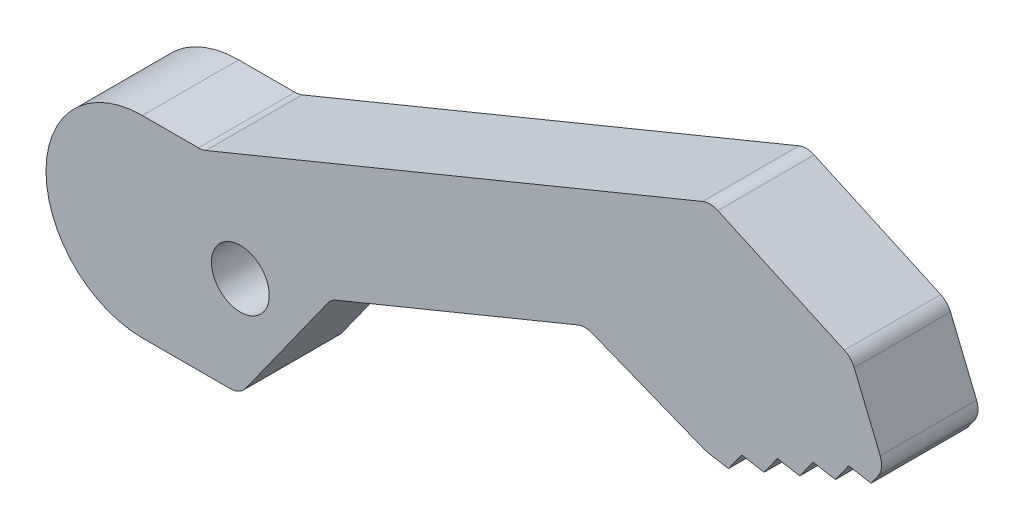
ISO-10303-21;
HEADER;
FILE_DESCRIPTION(('STEP AP214'),'2;1');
FILE_NAME('part.step','',(''),(''),'','','');
FILE_SCHEMA(('AUTOMOTIVE_DESIGN { 1 0 10303 214 1 1 1 1 }'));
ENDSEC;
DATA;
#1=APPLICATION_CONTEXT('core data for automotive mechanical design processes');
#2=APPLICATION_PROTOCOL_DEFINITION('international standard','automotive_design',2000,#1);
#3=PRODUCT_CONTEXT('',#1,'mechanical');
#4=PRODUCT('Part','Part','',(#3));
#5=PRODUCT_RELATED_PRODUCT_CATEGORY('part','',(#4));
#6=PRODUCT_DEFINITION_FORMATION('','',#4);
#7=PRODUCT_DEFINITION_CONTEXT('part definition',#1,'design');
#8=PRODUCT_DEFINITION('design','',#6,#7);
#9=PRODUCT_DEFINITION_SHAPE('','',#8);
#10=(LENGTH_UNIT() NAMED_UNIT(*) SI_UNIT(.MILLI.,.METRE.));
#11=(NAMED_UNIT(*) PLANE_ANGLE_UNIT() SI_UNIT($,.RADIAN.));
#12=(NAMED_UNIT(*) SI_UNIT($,.STERADIAN.) SOLID_ANGLE_UNIT());
#13=UNCERTAINTY_MEASURE_WITH_UNIT(LENGTH_MEASURE(1.E-05),#10,'distance_accuracy_value','');
#14=(GEOMETRIC_REPRESENTATION_CONTEXT(3) GLOBAL_UNCERTAINTY_ASSIGNED_CONTEXT((#13)) GLOBAL_UNIT_ASSIGNED_CONTEXT((#10,
#11,#12)) REPRESENTATION_CONTEXT('',''));
#15=CARTESIAN_POINT('',(0.,0.,0.));
#16=DIRECTION('',(0.,0.,1.));
#17=DIRECTION('',(1.,0.,0.));
#18=AXIS2_PLACEMENT_3D('',#15,#16,#17);
#19=CARTESIAN_POINT('',(0.,5.,5.));
#20=DIRECTION('',(0.,1.,0.));
#21=DIRECTION('',(-1.,0.,0.));
#22=AXIS2_PLACEMENT_3D('',#19,#20,#21);
#23=PLANE('',#22);
#24=DIRECTION('',(1.,0.,0.));
#25=VECTOR('',#24,1.);
#26=CARTESIAN_POINT('',(0.,5.,0.));
#27=LINE('',#26,#25);
#28=CARTESIAN_POINT('',(16.9362860205197,5.,0.));
#29=VERTEX_POINT('',#28);
#30=CARTESIAN_POINT('',(19.852448068055,5.,0.));
#31=VERTEX_POINT('',#30);
#32=EDGE_CURVE('E230',#29,#31,#27,.T.);
#33=ORIENTED_EDGE('',*,*,#32,.F.);
#34=DIRECTION('',(0.,0.,-1.));
#35=VECTOR('',#34,1.);
#36=CARTESIAN_POINT('',(16.9362860205197,5.,5.));
#37=LINE('',#36,#35);
#38=CARTESIAN_POINT('',(16.9362860205197,5.,5.));
#39=VERTEX_POINT('',#38);
#40=EDGE_CURVE('E57',#39,#29,#37,.T.);
#41=ORIENTED_EDGE('',*,*,#40,.F.);
#42=DIRECTION('',(1.,0.,0.));
#43=VECTOR('',#42,1.);
#44=CARTESIAN_POINT('',(0.,5.,5.));
#45=LINE('',#44,#43);
#46=CARTESIAN_POINT('',(19.852448068055,5.,5.));
#47=VERTEX_POINT('',#46);
#48=EDGE_CURVE('E228',#39,#47,#45,.T.);
#49=ORIENTED_EDGE('',*,*,#48,.T.);
#50=DIRECTION('',(0.,0.,-1.));
#51=VECTOR('',#50,1.);
#52=CARTESIAN_POINT('',(19.852448068055,5.,0.));
#53=LINE('',#52,#51);
#54=EDGE_CURVE('E378',#47,#31,#53,.T.);
#55=ORIENTED_EDGE('',*,*,#54,.T.);
#56=EDGE_LOOP('',(#33,#41,#49,#55));
#57=FACE_BOUND('',#56,.T.);
#58=ADVANCED_FACE('F42',(#57),#23,.T.);
#59=CARTESIAN_POINT('',(0.,-5.,5.));
#60=DIRECTION('',(0.,1.,0.));
#61=DIRECTION('',(-1.,0.,0.));
#62=AXIS2_PLACEMENT_3D('',#59,#60,#61);
#63=PLANE('',#62);
#64=DIRECTION('',(0.,0.,-1.));
#65=VECTOR('',#64,1.);
#66=CARTESIAN_POINT('',(16.9362860205197,-5.,5.));
#67=LINE('',#66,#65);
#68=CARTESIAN_POINT('',(16.9362860205197,-5.,5.));
#69=VERTEX_POINT('',#68);
#70=CARTESIAN_POINT('',(16.9362860205197,-5.,0.));
#71=VERTEX_POINT('',#70);
#72=EDGE_CURVE('E221',#69,#71,#67,.T.);
#73=ORIENTED_EDGE('',*,*,#72,.T.);
#74=DIRECTION('',(1.,0.,0.));
#75=VECTOR('',#74,1.);
#76=CARTESIAN_POINT('',(0.,-5.,0.));
#77=LINE('',#76,#75);
#78=CARTESIAN_POINT('',(21.4854150030195,-5.,0.));
#79=VERTEX_POINT('',#78);
#80=EDGE_CURVE('E298',#71,#79,#77,.T.);
#81=ORIENTED_EDGE('',*,*,#80,.T.);
#82=DIRECTION('',(0.,0.,-1.));
#83=VECTOR('',#82,1.);
#84=CARTESIAN_POINT('',(21.4854150030195,-5.,5.));
#85=LINE('',#84,#83);
#86=CARTESIAN_POINT('',(21.4854150030195,-5.,5.));
#87=VERTEX_POINT('',#86);
#88=EDGE_CURVE('E385',#79,#87,#85,.F.);
#89=ORIENTED_EDGE('',*,*,#88,.T.);
#90=DIRECTION('',(1.,0.,0.));
#91=VECTOR('',#90,1.);
#92=CARTESIAN_POINT('',(0.,-5.,5.));
#93=LINE('',#92,#91);
#94=EDGE_CURVE('E65',#69,#87,#93,.T.);
#95=ORIENTED_EDGE('',*,*,#94,.F.);
#96=EDGE_LOOP('',(#73,#81,#89,#95));
#97=FACE_BOUND('',#96,.T.);
#98=ADVANCED_FACE('F529',(#97),#63,.F.);
#99=CARTESIAN_POINT('',(16.9314341640706,-12.095211761983,5.));
#100=DIRECTION('',(0.813703233651607,-0.581280523968349,0.));
#101=DIRECTION('',(0.581280523968349,0.813703233651607,0.));
#102=AXIS2_PLACEMENT_3D('',#99,#100,#101);
#103=PLANE('',#102);
#104=DIRECTION('',(-0.581280523968349,-0.813703233651607,0.));
#105=VECTOR('',#104,1.);
#106=CARTESIAN_POINT('',(16.9314341640706,-12.095211761983,0.));
#107=LINE('',#106,#105);
#108=CARTESIAN_POINT('',(26.562618493048,1.38696338278466,0.));
#109=VERTEX_POINT('',#108);
#110=CARTESIAN_POINT('',(22.2991182366711,-4.58128052396835,0.));
#111=VERTEX_POINT('',#110);
#112=EDGE_CURVE('E250',#109,#111,#107,.T.);
#113=ORIENTED_EDGE('',*,*,#112,.F.);
#114=DIRECTION('',(0.,0.,-1.));
#115=VECTOR('',#114,1.);
#116=CARTESIAN_POINT('',(26.562618493048,1.38696338278465,5.));
#117=LINE('',#116,#115);
#118=CARTESIAN_POINT('',(26.562618493048,1.38696338278466,5.));
#119=VERTEX_POINT('',#118);
#120=EDGE_CURVE('E383',#109,#119,#117,.F.);
#121=ORIENTED_EDGE('',*,*,#120,.T.);
#122=DIRECTION('',(-0.581280523968349,-0.813703233651607,0.));
#123=VECTOR('',#122,1.);
#124=CARTESIAN_POINT('',(16.9314341640706,-12.095211761983,5.));
#125=LINE('',#124,#123);
#126=CARTESIAN_POINT('',(22.2991182366711,-4.58128052396835,5.));
#127=VERTEX_POINT('',#126);
#128=EDGE_CURVE('E412',#119,#127,#125,.T.);
#129=ORIENTED_EDGE('',*,*,#128,.T.);
#130=DIRECTION('',(0.,0.,-1.));
#131=VECTOR('',#130,1.);
#132=CARTESIAN_POINT('',(22.2991182366711,-4.58128052396835,0.));
#133=LINE('',#132,#131);
#134=EDGE_CURVE('E380',#127,#111,#133,.T.);
#135=ORIENTED_EDGE('',*,*,#134,.T.);
#136=EDGE_LOOP('',(#113,#121,#129,#135));
#137=FACE_BOUND('',#136,.T.);
#138=ADVANCED_FACE('F402',(#137),#103,.T.);
#139=CARTESIAN_POINT('',(3.2950033831404,-8.01412070884608,5.));
#140=DIRECTION('',(0.380263412733207,-0.924878228166549,0.));
#141=DIRECTION('',(0.924878228166549,0.380263412733207,0.));
#142=AXIS2_PLACEMENT_3D('',#139,#140,#141);
#143=PLANE('',#142);
#144=DIRECTION('',(-0.924878228166549,-0.380263412733207,0.));
#145=VECTOR('',#144,1.);
#146=CARTESIAN_POINT('',(3.2950033831404,-8.01412070884608,0.));
#147=LINE('',#146,#145);
#148=CARTESIAN_POINT('',(39.5264893293259,6.88244413040183,0.));
#149=VERTEX_POINT('',#148);
#150=CARTESIAN_POINT('',(26.9960583139664,1.73056108698286,0.));
#151=VERTEX_POINT('',#150);
#152=EDGE_CURVE('E253',#149,#151,#147,.T.);
#153=ORIENTED_EDGE('',*,*,#152,.F.);
#154=DIRECTION('',(0.,0.,-1.));
#155=VECTOR('',#154,1.);
#156=CARTESIAN_POINT('',(39.5264893293259,6.88244413040183,5.));
#157=LINE('',#156,#155);
#158=CARTESIAN_POINT('',(39.5264893293259,6.88244413040183,5.));
#159=VERTEX_POINT('',#158);
#160=EDGE_CURVE('E359',#149,#159,#157,.F.);
#161=ORIENTED_EDGE('',*,*,#160,.T.);
#162=DIRECTION('',(-0.924878228166549,-0.380263412733207,0.));
#163=VECTOR('',#162,1.);
#164=CARTESIAN_POINT('',(3.2950033831404,-8.01412070884608,5.));
#165=LINE('',#164,#163);
#166=CARTESIAN_POINT('',(26.9960583139664,1.73056108698286,5.));
#167=VERTEX_POINT('',#166);
#168=EDGE_CURVE('E410',#159,#167,#165,.T.);
#169=ORIENTED_EDGE('',*,*,#168,.T.);
#170=DIRECTION('',(0.,0.,-1.));
#171=VECTOR('',#170,1.);
#172=CARTESIAN_POINT('',(26.9960583139664,1.73056108698285,0.));
#173=LINE('',#172,#171);
#174=EDGE_CURVE('E356',#167,#151,#173,.T.);
#175=ORIENTED_EDGE('',*,*,#174,.T.);
#176=EDGE_LOOP('',(#153,#161,#169,#175));
#177=FACE_BOUND('',#176,.T.);
#178=ADVANCED_FACE('F414',(#177),#143,.T.);
#179=CARTESIAN_POINT('',(7.84369243763637,19.7605066346556,5.));
#180=DIRECTION('',(-0.368935795459582,-0.929454882621317,0.));
#181=DIRECTION('',(0.929454882621317,-0.368935795459582,0.));
#182=AXIS2_PLACEMENT_3D('',#179,#180,#181);
#183=PLANE('',#182);
#184=DIRECTION('',(-0.929454882621317,0.368935795459582,0.));
#185=VECTOR('',#184,1.);
#186=CARTESIAN_POINT('',(7.84369243763637,19.7605066346556,0.));
#187=LINE('',#186,#185);
#188=CARTESIAN_POINT('',(46.0925277874036,4.57809729019016,0.));
#189=VERTEX_POINT('',#188);
#190=CARTESIAN_POINT('',(40.2756885375187,6.8870207848566,0.));
#191=VERTEX_POINT('',#190);
#192=EDGE_CURVE('E256',#189,#191,#187,.T.);
#193=ORIENTED_EDGE('',*,*,#192,.F.);
#194=DIRECTION('',(0.,0.,-1.));
#195=VECTOR('',#194,1.);
#196=CARTESIAN_POINT('',(46.0925277874036,4.57809729019016,5.));
#197=LINE('',#196,#195);
#198=CARTESIAN_POINT('',(46.0925277874036,4.57809729019016,5.));
#199=VERTEX_POINT('',#198);
#200=EDGE_CURVE('E344',#189,#199,#197,.F.);
#201=ORIENTED_EDGE('',*,*,#200,.T.);
#202=DIRECTION('',(-0.929454882621317,0.368935795459582,0.));
#203=VECTOR('',#202,1.);
#204=CARTESIAN_POINT('',(7.84369243763637,19.7605066346556,5.));
#205=LINE('',#204,#203);
#206=CARTESIAN_POINT('',(40.2756885375187,6.8870207848566,5.));
#207=VERTEX_POINT('',#206);
#208=EDGE_CURVE('E416',#199,#207,#205,.T.);
#209=ORIENTED_EDGE('',*,*,#208,.T.);
#210=DIRECTION('',(0.,0.,-1.));
#211=VECTOR('',#210,1.);
#212=CARTESIAN_POINT('',(40.2756885375187,6.8870207848566,0.));
#213=LINE('',#212,#211);
#214=EDGE_CURVE('E341',#207,#191,#213,.T.);
#215=ORIENTED_EDGE('',*,*,#214,.T.);
#216=EDGE_LOOP('',(#193,#201,#209,#215));
#217=FACE_BOUND('',#216,.T.);
#218=ADVANCED_FACE('F515',(#217),#183,.T.);
#219=CARTESIAN_POINT('',(2.1206872505527,12.200106201943,5.));
#220=DIRECTION('',(0.171257275030372,0.985226342395072,0.));
#221=DIRECTION('',(-0.985226342395072,0.171257275030372,0.));
#222=AXIS2_PLACEMENT_3D('',#219,#220,#221);
#223=PLANE('',#222);
#224=DIRECTION('',(0.985226342395072,-0.171257275030372,0.));
#225=VECTOR('',#224,1.);
#226=CARTESIAN_POINT('',(2.1206872505527,12.200106201943,5.));
#227=LINE('',#226,#225);
#228=CARTESIAN_POINT('',(46.2902063078328,4.52232583041641,5.));
#229=VERTEX_POINT('',#228);
#230=CARTESIAN_POINT('',(47.3529322035688,4.33759717145107,5.));
#231=VERTEX_POINT('',#230);
#232=EDGE_CURVE('E419',#229,#231,#227,.T.);
#233=ORIENTED_EDGE('',*,*,#232,.F.);
#234=DIRECTION('',(0.,0.,-1.));
#235=VECTOR('',#234,1.);
#236=CARTESIAN_POINT('',(46.2902063078328,4.52232583041641,0.));
#237=LINE('',#236,#235);
#238=CARTESIAN_POINT('',(46.2902063078328,4.52232583041641,0.));
#239=VERTEX_POINT('',#238);
#240=EDGE_CURVE('E327',#229,#239,#237,.T.);
#241=ORIENTED_EDGE('',*,*,#240,.T.);
#242=DIRECTION('',(0.985226342395072,-0.171257275030372,0.));
#243=VECTOR('',#242,1.);
#244=CARTESIAN_POINT('',(2.1206872505527,12.200106201943,0.));
#245=LINE('',#244,#243);
#246=CARTESIAN_POINT('',(47.3529322035688,4.33759717145107,0.));
#247=VERTEX_POINT('',#246);
#248=EDGE_CURVE('E259',#239,#247,#245,.T.);
#249=ORIENTED_EDGE('',*,*,#248,.T.);
#250=DIRECTION('',(0.,0.,-1.));
#251=VECTOR('',#250,1.);
#252=CARTESIAN_POINT('',(47.3529322035688,4.33759717145107,5.));
#253=LINE('',#252,#251);
#254=EDGE_CURVE('E324',#231,#247,#253,.T.);
#255=ORIENTED_EDGE('',*,*,#254,.F.);
#256=EDGE_LOOP('',(#233,#241,#249,#255));
#257=FACE_BOUND('',#256,.T.);
#258=ADVANCED_FACE('F507',(#257),#223,.F.);
#259=CARTESIAN_POINT('',(29.3832302084348,-20.911746854221,5.));
#260=DIRECTION('',(-0.814732571298572,0.579836905746105,0.));
#261=DIRECTION('',(-0.579836905746105,-0.814732571298572,0.));
#262=AXIS2_PLACEMENT_3D('',#259,#260,#261);
#263=PLANE('',#262);
#264=DIRECTION('',(0.579836905746105,0.814732571298572,0.));
#265=VECTOR('',#264,1.);
#266=CARTESIAN_POINT('',(29.3832302084348,-20.911746854221,0.));
#267=LINE('',#266,#265);
#268=CARTESIAN_POINT('',(48.0382444817135,5.30053386792921,0.));
#269=VERTEX_POINT('',#268);
#270=EDGE_CURVE('E261',#247,#269,#267,.T.);
#271=ORIENTED_EDGE('',*,*,#270,.T.);
#272=DIRECTION('',(0.,0.,-1.));
#273=VECTOR('',#272,1.);
#274=CARTESIAN_POINT('',(48.0382444817135,5.30053386792921,5.));
#275=LINE('',#274,#273);
#276=CARTESIAN_POINT('',(48.0382444817135,5.30053386792921,5.));
#277=VERTEX_POINT('',#276);
#278=EDGE_CURVE('E321',#277,#269,#275,.T.);
#279=ORIENTED_EDGE('',*,*,#278,.F.);
#280=DIRECTION('',(0.579836905746105,0.814732571298572,0.));
#281=VECTOR('',#280,1.);
#282=CARTESIAN_POINT('',(29.3832302084348,-20.911746854221,5.));
#283=LINE('',#282,#281);
#284=EDGE_CURVE('E425',#231,#277,#283,.T.);
#285=ORIENTED_EDGE('',*,*,#284,.F.);
#286=ORIENTED_EDGE('',*,*,#254,.T.);
#287=EDGE_LOOP('',(#271,#279,#285,#286));
#288=FACE_BOUND('',#287,.T.);
#289=ADVANCED_FACE('F504',(#288),#263,.F.);
#290=CARTESIAN_POINT('',(2.30326040358765,13.2504316830204,5.));
#291=DIRECTION('',(0.171257275030363,0.985226342395074,0.));
#292=DIRECTION('',(-0.985226342395074,0.171257275030363,0.));
#293=AXIS2_PLACEMENT_3D('',#290,#291,#292);
#294=PLANE('',#293);
#295=DIRECTION('',(0.985226342395074,-0.171257275030363,0.));
#296=VECTOR('',#295,1.);
#297=CARTESIAN_POINT('',(2.30326040358765,13.2504316830204,0.));
#298=LINE('',#297,#296);
#299=CARTESIAN_POINT('',(49.2026886599019,5.09812399691749,0.));
#300=VERTEX_POINT('',#299);
#301=EDGE_CURVE('E264',#269,#300,#298,.T.);
#302=ORIENTED_EDGE('',*,*,#301,.T.);
#303=DIRECTION('',(0.,0.,-1.));
#304=VECTOR('',#303,1.);
#305=CARTESIAN_POINT('',(49.2026886599019,5.09812399691749,5.));
#306=LINE('',#305,#304);
#307=CARTESIAN_POINT('',(49.2026886599019,5.09812399691749,5.));
#308=VERTEX_POINT('',#307);
#309=EDGE_CURVE('E318',#308,#300,#306,.T.);
#310=ORIENTED_EDGE('',*,*,#309,.F.);
#311=DIRECTION('',(0.985226342395074,-0.171257275030363,0.));
#312=VECTOR('',#311,1.);
#313=CARTESIAN_POINT('',(2.30326040358765,13.2504316830204,5.));
#314=LINE('',#313,#312);
#315=EDGE_CURVE('E428',#277,#308,#314,.T.);
#316=ORIENTED_EDGE('',*,*,#315,.F.);
#317=ORIENTED_EDGE('',*,*,#278,.T.);
#318=EDGE_LOOP('',(#302,#310,#316,#317));
#319=FACE_BOUND('',#318,.T.);
#320=ADVANCED_FACE('F497',(#319),#294,.F.);
#321=CARTESIAN_POINT('',(30.2517964891724,-21.5298966648462,5.));
#322=DIRECTION('',(-0.814732571298571,0.579836905746107,0.));
#323=DIRECTION('',(-0.579836905746107,-0.814732571298571,0.));
#324=AXIS2_PLACEMENT_3D('',#321,#322,#323);
#325=PLANE('',#324);
#326=DIRECTION('',(0.579836905746107,0.814732571298571,0.));
#327=VECTOR('',#326,1.);
#328=CARTESIAN_POINT('',(30.2517964891724,-21.5298966648462,0.));
#329=LINE('',#328,#327);
#330=CARTESIAN_POINT('',(49.8880009380466,6.06106069339563,0.));
#331=VERTEX_POINT('',#330);
#332=EDGE_CURVE('E267',#300,#331,#329,.T.);
#333=ORIENTED_EDGE('',*,*,#332,.T.);
#334=DIRECTION('',(0.,0.,-1.));
#335=VECTOR('',#334,1.);
#336=CARTESIAN_POINT('',(49.8880009380466,6.06106069339563,5.));
#337=LINE('',#336,#335);
#338=CARTESIAN_POINT('',(49.8880009380466,6.06106069339563,5.));
#339=VERTEX_POINT('',#338);
#340=EDGE_CURVE('E315',#339,#331,#337,.T.);
#341=ORIENTED_EDGE('',*,*,#340,.F.);
#342=DIRECTION('',(0.579836905746107,0.814732571298571,0.));
#343=VECTOR('',#342,1.);
#344=CARTESIAN_POINT('',(30.2517964891724,-21.5298966648462,5.));
#345=LINE('',#344,#343);
#346=EDGE_CURVE('E431',#308,#339,#345,.T.);
#347=ORIENTED_EDGE('',*,*,#346,.F.);
#348=ORIENTED_EDGE('',*,*,#309,.T.);
#349=EDGE_LOOP('',(#333,#341,#347,#348));
#350=FACE_BOUND('',#349,.T.);
#351=ADVANCED_FACE('F494',(#350),#325,.F.);
#352=CARTESIAN_POINT('',(2.48583355662284,14.3007571640983,5.));
#353=DIRECTION('',(0.171257275030366,0.985226342395073,0.));
#354=DIRECTION('',(-0.985226342395073,0.171257275030366,0.));
#355=AXIS2_PLACEMENT_3D('',#352,#353,#354);
#356=PLANE('',#355);
#357=DIRECTION('',(0.985226342395073,-0.171257275030366,0.));
#358=VECTOR('',#357,1.);
#359=CARTESIAN_POINT('',(2.48583355662284,14.3007571640983,0.));
#360=LINE('',#359,#358);
#361=CARTESIAN_POINT('',(51.052445116235,5.85865082238391,0.));
#362=VERTEX_POINT('',#361);
#363=EDGE_CURVE('E270',#331,#362,#360,.T.);
#364=ORIENTED_EDGE('',*,*,#363,.T.);
#365=DIRECTION('',(0.,0.,-1.));
#366=VECTOR('',#365,1.);
#367=CARTESIAN_POINT('',(51.052445116235,5.85865082238391,5.));
#368=LINE('',#367,#366);
#369=CARTESIAN_POINT('',(51.052445116235,5.85865082238391,5.));
#370=VERTEX_POINT('',#369);
#371=EDGE_CURVE('E312',#370,#362,#368,.T.);
#372=ORIENTED_EDGE('',*,*,#371,.F.);
#373=DIRECTION('',(0.985226342395073,-0.171257275030366,0.));
#374=VECTOR('',#373,1.);
#375=CARTESIAN_POINT('',(2.48583355662284,14.3007571640983,5.));
#376=LINE('',#375,#374);
#377=EDGE_CURVE('E434',#339,#370,#376,.T.);
#378=ORIENTED_EDGE('',*,*,#377,.F.);
#379=ORIENTED_EDGE('',*,*,#340,.T.);
#380=EDGE_LOOP('',(#364,#372,#378,#379));
#381=FACE_BOUND('',#380,.T.);
#382=ADVANCED_FACE('F492',(#381),#356,.F.);
#383=CARTESIAN_POINT('',(31.1203627699101,-22.1480464754713,5.));
#384=DIRECTION('',(-0.814732571298571,0.579836905746106,0.));
#385=DIRECTION('',(-0.579836905746106,-0.814732571298571,0.));
#386=AXIS2_PLACEMENT_3D('',#383,#384,#385);
#387=PLANE('',#386);
#388=DIRECTION('',(0.579836905746106,0.814732571298571,0.));
#389=VECTOR('',#388,1.);
#390=CARTESIAN_POINT('',(31.1203627699101,-22.1480464754713,0.));
#391=LINE('',#390,#389);
#392=CARTESIAN_POINT('',(51.7377573943797,6.82158751886204,0.));
#393=VERTEX_POINT('',#392);
#394=EDGE_CURVE('E273',#362,#393,#391,.T.);
#395=ORIENTED_EDGE('',*,*,#394,.T.);
#396=DIRECTION('',(0.,0.,-1.));
#397=VECTOR('',#396,1.);
#398=CARTESIAN_POINT('',(51.7377573943797,6.82158751886204,5.));
#399=LINE('',#398,#397);
#400=CARTESIAN_POINT('',(51.7377573943797,6.82158751886204,5.));
#401=VERTEX_POINT('',#400);
#402=EDGE_CURVE('E309',#401,#393,#399,.T.);
#403=ORIENTED_EDGE('',*,*,#402,.F.);
#404=DIRECTION('',(0.579836905746106,0.814732571298571,0.));
#405=VECTOR('',#404,1.);
#406=CARTESIAN_POINT('',(31.1203627699101,-22.1480464754713,5.));
#407=LINE('',#406,#405);
#408=EDGE_CURVE('E437',#370,#401,#407,.T.);
#409=ORIENTED_EDGE('',*,*,#408,.F.);
#410=ORIENTED_EDGE('',*,*,#371,.T.);
#411=EDGE_LOOP('',(#395,#403,#409,#410));
#412=FACE_BOUND('',#411,.T.);
#413=ADVANCED_FACE('F488',(#412),#387,.F.);
#414=CARTESIAN_POINT('',(2.6684067096581,15.3510826451762,5.));
#415=DIRECTION('',(0.171257275030372,0.985226342395072,0.));
#416=DIRECTION('',(-0.985226342395072,0.171257275030372,0.));
#417=AXIS2_PLACEMENT_3D('',#414,#415,#416);
#418=PLANE('',#417);
#419=DIRECTION('',(0.985226342395072,-0.171257275030372,0.));
#420=VECTOR('',#419,1.);
#421=CARTESIAN_POINT('',(2.6684067096581,15.3510826451762,0.));
#422=LINE('',#421,#420);
#423=CARTESIAN_POINT('',(52.9022015725681,6.61917764785032,0.));
#424=VERTEX_POINT('',#423);
#425=EDGE_CURVE('E276',#393,#424,#422,.T.);
#426=ORIENTED_EDGE('',*,*,#425,.T.);
#427=DIRECTION('',(0.,0.,-1.));
#428=VECTOR('',#427,1.);
#429=CARTESIAN_POINT('',(52.9022015725681,6.61917764785032,5.));
#430=LINE('',#429,#428);
#431=CARTESIAN_POINT('',(52.9022015725681,6.61917764785032,5.));
#432=VERTEX_POINT('',#431);
#433=EDGE_CURVE('E306',#432,#424,#430,.T.);
#434=ORIENTED_EDGE('',*,*,#433,.F.);
#435=DIRECTION('',(0.985226342395072,-0.171257275030372,0.));
#436=VECTOR('',#435,1.);
#437=CARTESIAN_POINT('',(2.6684067096581,15.3510826451762,5.));
#438=LINE('',#437,#436);
#439=EDGE_CURVE('E440',#401,#432,#438,.T.);
#440=ORIENTED_EDGE('',*,*,#439,.F.);
#441=ORIENTED_EDGE('',*,*,#402,.T.);
#442=EDGE_LOOP('',(#426,#434,#440,#441));
#443=FACE_BOUND('',#442,.T.);
#444=ADVANCED_FACE('F485',(#443),#418,.F.);
#445=CARTESIAN_POINT('',(31.988929050648,-22.7661962860963,5.));
#446=DIRECTION('',(-0.814732571298574,0.579836905746102,0.));
#447=DIRECTION('',(-0.579836905746102,-0.814732571298574,0.));
#448=AXIS2_PLACEMENT_3D('',#445,#446,#447);
#449=PLANE('',#448);
#450=DIRECTION('',(0.579836905746102,0.814732571298574,0.));
#451=VECTOR('',#450,1.);
#452=CARTESIAN_POINT('',(31.988929050648,-22.7661962860963,0.));
#453=LINE('',#452,#451);
#454=CARTESIAN_POINT('',(53.5875138507127,7.58211434432845,0.));
#455=VERTEX_POINT('',#454);
#456=EDGE_CURVE('E279',#424,#455,#453,.T.);
#457=ORIENTED_EDGE('',*,*,#456,.T.);
#458=DIRECTION('',(0.,0.,-1.));
#459=VECTOR('',#458,1.);
#460=CARTESIAN_POINT('',(53.5875138507127,7.58211434432845,5.));
#461=LINE('',#460,#459);
#462=CARTESIAN_POINT('',(53.5875138507127,7.58211434432845,5.));
#463=VERTEX_POINT('',#462);
#464=EDGE_CURVE('E303',#463,#455,#461,.T.);
#465=ORIENTED_EDGE('',*,*,#464,.F.);
#466=DIRECTION('',(0.579836905746102,0.814732571298574,0.));
#467=VECTOR('',#466,1.);
#468=CARTESIAN_POINT('',(31.988929050648,-22.7661962860963,5.));
#469=LINE('',#468,#467);
#470=EDGE_CURVE('E443',#432,#463,#469,.T.);
#471=ORIENTED_EDGE('',*,*,#470,.F.);
#472=ORIENTED_EDGE('',*,*,#433,.T.);
#473=EDGE_LOOP('',(#457,#465,#471,#472));
#474=FACE_BOUND('',#473,.T.);
#475=ADVANCED_FACE('F483',(#474),#449,.F.);
#476=CARTESIAN_POINT('',(2.85097986269314,16.4014081262538,5.));
#477=DIRECTION('',(0.171257275030369,0.985226342395073,0.));
#478=DIRECTION('',(-0.985226342395073,0.171257275030369,0.));
#479=AXIS2_PLACEMENT_3D('',#476,#477,#478);
#480=PLANE('',#479);
#481=DIRECTION('',(0.985226342395072,-0.171257275030369,0.));
#482=VECTOR('',#481,1.);
#483=CARTESIAN_POINT('',(2.85097986269314,16.4014081262538,0.));
#484=LINE('',#483,#482);
#485=CARTESIAN_POINT('',(54.7519580289012,7.37970447331673,0.));
#486=VERTEX_POINT('',#485);
#487=EDGE_CURVE('E282',#455,#486,#484,.T.);
#488=ORIENTED_EDGE('',*,*,#487,.T.);
#489=DIRECTION('',(0.,0.,-1.));
#490=VECTOR('',#489,1.);
#491=CARTESIAN_POINT('',(54.7519580289012,7.37970447331673,5.));
#492=LINE('',#491,#490);
#493=CARTESIAN_POINT('',(54.7519580289012,7.37970447331673,5.));
#494=VERTEX_POINT('',#493);
#495=EDGE_CURVE('E240',#494,#486,#492,.T.);
#496=ORIENTED_EDGE('',*,*,#495,.F.);
#497=DIRECTION('',(0.985226342395072,-0.171257275030369,0.));
#498=VECTOR('',#497,1.);
#499=CARTESIAN_POINT('',(2.85097986269314,16.4014081262538,5.));
#500=LINE('',#499,#498);
#501=EDGE_CURVE('E446',#463,#494,#500,.T.);
#502=ORIENTED_EDGE('',*,*,#501,.F.);
#503=ORIENTED_EDGE('',*,*,#464,.T.);
#504=EDGE_LOOP('',(#488,#496,#502,#503));
#505=FACE_BOUND('',#504,.T.);
#506=ADVANCED_FACE('F479',(#505),#480,.F.);
#507=CARTESIAN_POINT('',(32.8574953313853,-23.3843460967215,5.));
#508=DIRECTION('',(-0.814732571298571,0.579836905746107,0.));
#509=DIRECTION('',(-0.579836905746107,-0.814732571298571,0.));
#510=AXIS2_PLACEMENT_3D('',#507,#508,#509);
#511=PLANE('',#510);
#512=DIRECTION('',(0.579836905746107,0.814732571298571,0.));
#513=VECTOR('',#512,1.);
#514=CARTESIAN_POINT('',(32.8574953313853,-23.3843460967215,0.));
#515=LINE('',#514,#513);
#516=CARTESIAN_POINT('',(55.1172552795212,7.89298599323482,0.));
#517=VERTEX_POINT('',#516);
#518=EDGE_CURVE('E285',#486,#517,#515,.T.);
#519=ORIENTED_EDGE('',*,*,#518,.T.);
#520=DIRECTION('',(0.,0.,-1.));
#521=VECTOR('',#520,1.);
#522=CARTESIAN_POINT('',(55.1172552795212,7.89298599323482,5.));
#523=LINE('',#522,#521);
#524=CARTESIAN_POINT('',(55.1172552795212,7.89298599323482,5.));
#525=VERTEX_POINT('',#524);
#526=EDGE_CURVE('E371',#517,#525,#523,.F.);
#527=ORIENTED_EDGE('',*,*,#526,.T.);
#528=DIRECTION('',(0.579836905746107,0.814732571298571,0.));
#529=VECTOR('',#528,1.);
#530=CARTESIAN_POINT('',(32.8574953313853,-23.3843460967215,5.));
#531=LINE('',#530,#529);
#532=EDGE_CURVE('E449',#494,#525,#531,.T.);
#533=ORIENTED_EDGE('',*,*,#532,.F.);
#534=ORIENTED_EDGE('',*,*,#495,.T.);
#535=EDGE_LOOP('',(#519,#527,#533,#534));
#536=FACE_BOUND('',#535,.T.);
#537=ADVANCED_FACE('F476',(#536),#511,.F.);
#538=CARTESIAN_POINT('',(50.3551112402657,20.7034892439218,5.));
#539=DIRECTION('',(0.92487822816655,0.380263412733205,0.));
#540=DIRECTION('',(-0.380263412733205,0.92487822816655,0.));
#541=AXIS2_PLACEMENT_3D('',#538,#539,#540);
#542=PLANE('',#541);
#543=DIRECTION('',(0.380263412733205,-0.92487822816655,0.));
#544=VECTOR('',#543,1.);
#545=CARTESIAN_POINT('',(50.3551112402657,20.7034892439218,0.));
#546=LINE('',#545,#544);
#547=CARTESIAN_POINT('',(53.8764912996726,12.138774256918,0.));
#548=VERTEX_POINT('',#547);
#549=CARTESIAN_POINT('',(55.2274009363892,8.85308631171414,0.));
#550=VERTEX_POINT('',#549);
#551=EDGE_CURVE('E288',#548,#550,#546,.T.);
#552=ORIENTED_EDGE('',*,*,#551,.F.);
#553=DIRECTION('',(0.,0.,-1.));
#554=VECTOR('',#553,1.);
#555=CARTESIAN_POINT('',(53.8764912996726,12.138774256918,5.));
#556=LINE('',#555,#554);
#557=CARTESIAN_POINT('',(53.8764912996726,12.138774256918,5.));
#558=VERTEX_POINT('',#557);
#559=EDGE_CURVE('E369',#548,#558,#556,.F.);
#560=ORIENTED_EDGE('',*,*,#559,.T.);
#561=DIRECTION('',(0.380263412733205,-0.92487822816655,0.));
#562=VECTOR('',#561,1.);
#563=CARTESIAN_POINT('',(50.3551112402657,20.7034892439218,5.));
#564=LINE('',#563,#562);
#565=CARTESIAN_POINT('',(55.2274009363892,8.85308631171414,5.));
#566=VERTEX_POINT('',#565);
#567=EDGE_CURVE('E452',#558,#566,#564,.T.);
#568=ORIENTED_EDGE('',*,*,#567,.T.);
#569=DIRECTION('',(0.,0.,-1.));
#570=VECTOR('',#569,1.);
#571=CARTESIAN_POINT('',(55.2274009363892,8.85308631171414,0.));
#572=LINE('',#571,#570);
#573=EDGE_CURVE('E366',#566,#550,#572,.T.);
#574=ORIENTED_EDGE('',*,*,#573,.T.);
#575=EDGE_LOOP('',(#552,#560,#568,#574));
#576=FACE_BOUND('',#575,.T.);
#577=ADVANCED_FACE('F468',(#576),#542,.T.);
#578=CARTESIAN_POINT('',(13.9488099268583,30.6231164748253,5.));
#579=DIRECTION('',(0.414522259932086,0.910039172794664,0.));
#580=DIRECTION('',(-0.910039172794664,0.414522259932086,0.));
#581=AXIS2_PLACEMENT_3D('',#578,#579,#580);
#582=PLANE('',#581);
#583=DIRECTION('',(0.910039172794664,-0.414522259932086,0.));
#584=VECTOR('',#583,1.);
#585=CARTESIAN_POINT('',(13.9488099268583,30.6231164748253,5.));
#586=LINE('',#585,#584);
#587=CARTESIAN_POINT('',(46.8032086062433,15.6579589338968,5.));
#588=VERTEX_POINT('',#587);
#589=CARTESIAN_POINT('',(53.3661353314382,12.6685500169795,5.));
#590=VERTEX_POINT('',#589);
#591=EDGE_CURVE('E243',#588,#590,#586,.T.);
#592=ORIENTED_EDGE('',*,*,#591,.T.);
#593=DIRECTION('',(0.,0.,-1.));
#594=VECTOR('',#593,1.);
#595=CARTESIAN_POINT('',(53.3661353314382,12.6685500169795,5.));
#596=LINE('',#595,#594);
#597=CARTESIAN_POINT('',(53.3661353314382,12.6685500169795,0.));
#598=VERTEX_POINT('',#597);
#599=EDGE_CURVE('E363',#590,#598,#596,.T.);
#600=ORIENTED_EDGE('',*,*,#599,.T.);
#601=DIRECTION('',(0.910039172794664,-0.414522259932086,0.));
#602=VECTOR('',#601,1.);
#603=CARTESIAN_POINT('',(13.9488099268583,30.6231164748253,0.));
#604=LINE('',#603,#602);
#605=CARTESIAN_POINT('',(46.8032086062433,15.6579589338968,0.));
#606=VERTEX_POINT('',#605);
#607=EDGE_CURVE('E291',#606,#598,#604,.T.);
#608=ORIENTED_EDGE('',*,*,#607,.F.);
#609=DIRECTION('',(0.,0.,-1.));
#610=VECTOR('',#609,1.);
#611=CARTESIAN_POINT('',(46.8032086062433,15.6579589338968,5.));
#612=LINE('',#611,#610);
#613=EDGE_CURVE('E361',#606,#588,#612,.F.);
#614=ORIENTED_EDGE('',*,*,#613,.T.);
#615=EDGE_LOOP('',(#592,#600,#608,#614));
#616=FACE_BOUND('',#615,.T.);
#617=ADVANCED_FACE('F458',(#616),#582,.T.);
#618=CARTESIAN_POINT('',(1.14074851739701,-2.77453321099285,5.));
#619=DIRECTION('',(-0.380263412733207,0.924878228166549,0.));
#620=DIRECTION('',(-0.924878228166549,-0.380263412733207,0.));
#621=AXIS2_PLACEMENT_3D('',#618,#619,#620);
#622=PLANE('',#621);
#623=DIRECTION('',(0.924878228166549,0.380263412733207,0.));
#624=VECTOR('',#623,1.);
#625=CARTESIAN_POINT('',(1.14074851739701,-2.77453321099285,5.));
#626=LINE('',#625,#624);
#627=CARTESIAN_POINT('',(20.2327114807882,5.07512177183345,5.));
#628=VERTEX_POINT('',#627);
#629=CARTESIAN_POINT('',(46.008422933578,15.6727979892687,5.));
#630=VERTEX_POINT('',#629);
#631=EDGE_CURVE('E238',#628,#630,#626,.T.);
#632=ORIENTED_EDGE('',*,*,#631,.T.);
#633=DIRECTION('',(0.,0.,-1.));
#634=VECTOR('',#633,1.);
#635=CARTESIAN_POINT('',(46.008422933578,15.6727979892687,5.));
#636=LINE('',#635,#634);
#637=CARTESIAN_POINT('',(46.008422933578,15.6727979892687,0.));
#638=VERTEX_POINT('',#637);
#639=EDGE_CURVE('E375',#630,#638,#636,.T.);
#640=ORIENTED_EDGE('',*,*,#639,.T.);
#641=DIRECTION('',(0.924878228166549,0.380263412733207,0.));
#642=VECTOR('',#641,1.);
#643=CARTESIAN_POINT('',(1.14074851739701,-2.77453321099285,0.));
#644=LINE('',#643,#642);
#645=CARTESIAN_POINT('',(20.2327114807882,5.07512177183345,0.));
#646=VERTEX_POINT('',#645);
#647=EDGE_CURVE('E294',#646,#638,#644,.T.);
#648=ORIENTED_EDGE('',*,*,#647,.F.);
#649=DIRECTION('',(0.,0.,-1.));
#650=VECTOR('',#649,1.);
#651=CARTESIAN_POINT('',(20.2327114807882,5.07512177183345,5.));
#652=LINE('',#651,#650);
#653=EDGE_CURVE('E373',#646,#628,#652,.F.);
#654=ORIENTED_EDGE('',*,*,#653,.T.);
#655=EDGE_LOOP('',(#632,#640,#648,#654));
#656=FACE_BOUND('',#655,.T.);
#657=ADVANCED_FACE('F538',(#656),#622,.T.);
#658=CARTESIAN_POINT('',(22.0207052746916,0.206842568432915,5.));
#659=DIRECTION('',(0.,0.,-1.));
#660=DIRECTION('',(-1.,0.,0.));
#661=AXIS2_PLACEMENT_3D('',#658,#659,#660);
#662=CYLINDRICAL_SURFACE('',#661,1.5);
#663=CARTESIAN_POINT('',(22.0207052746916,0.206842568432915,5.));
#664=DIRECTION('',(0.,0.,1.));
#665=DIRECTION('',(1.,0.,0.));
#666=AXIS2_PLACEMENT_3D('',#663,#664,#665);
#667=CIRCLE('',#666,1.5);
#668=CARTESIAN_POINT('',(23.5207052746916,0.206842568432915,5.));
#669=VERTEX_POINT('',#668);
#670=EDGE_CURVE('E300',#669,#669,#667,.T.);
#671=ORIENTED_EDGE('',*,*,#670,.T.);
#672=EDGE_LOOP('',(#671));
#673=FACE_BOUND('',#672,.T.);
#674=CARTESIAN_POINT('',(22.0207052746916,0.206842568432915,0.));
#675=DIRECTION('',(0.,0.,1.));
#676=DIRECTION('',(1.,0.,0.));
#677=AXIS2_PLACEMENT_3D('',#674,#675,#676);
#678=CIRCLE('',#677,1.5);
#679=CARTESIAN_POINT('',(23.5207052746916,0.206842568432915,0.));
#680=VERTEX_POINT('',#679);
#681=EDGE_CURVE('E247',#680,#680,#678,.T.);
#682=ORIENTED_EDGE('',*,*,#681,.F.);
#683=EDGE_LOOP('',(#682));
#684=FACE_BOUND('',#683,.T.);
#685=ADVANCED_FACE('F541',(#673,#684),#662,.F.);
#686=CARTESIAN_POINT('',(0.,0.,5.));
#687=DIRECTION('',(0.,0.,1.));
#688=DIRECTION('',(1.,0.,0.));
#689=AXIS2_PLACEMENT_3D('',#686,#687,#688);
#690=PLANE('',#689);
#691=CARTESIAN_POINT('',(16.9362860205197,0.,5.));
#692=DIRECTION('',(0.,0.,1.));
#693=DIRECTION('',(1.,0.,0.));
#694=AXIS2_PLACEMENT_3D('',#691,#692,#693);
#695=CIRCLE('',#694,5.);
#696=EDGE_CURVE('E218',#39,#69,#695,.T.);
#697=ORIENTED_EDGE('',*,*,#696,.T.);
#698=ORIENTED_EDGE('',*,*,#94,.T.);
#699=CARTESIAN_POINT('',(21.4854150030195,-4.,5.));
#700=DIRECTION('',(0.,0.,1.));
#701=DIRECTION('',(1.,0.,0.));
#702=AXIS2_PLACEMENT_3D('',#699,#700,#701);
#703=CIRCLE('',#702,1.);
#704=EDGE_CURVE('E346',#87,#127,#703,.T.);
#705=ORIENTED_EDGE('',*,*,#704,.T.);
#706=ORIENTED_EDGE('',*,*,#128,.F.);
#707=CARTESIAN_POINT('',(27.3763217266996,0.805682858816307,5.));
#708=DIRECTION('',(0.,0.,1.));
#709=DIRECTION('',(1.,0.,0.));
#710=AXIS2_PLACEMENT_3D('',#707,#708,#709);
#711=CIRCLE('',#710,1.);
#712=EDGE_CURVE('E11',#119,#167,#711,.F.);
#713=ORIENTED_EDGE('',*,*,#712,.T.);
#714=ORIENTED_EDGE('',*,*,#168,.F.);
#715=CARTESIAN_POINT('',(39.9067527420591,5.95756590223528,5.));
#716=DIRECTION('',(0.,0.,1.));
#717=DIRECTION('',(1.,0.,0.));
#718=AXIS2_PLACEMENT_3D('',#715,#716,#717);
#719=CIRCLE('',#718,1.);
#720=EDGE_CURVE('E389',#159,#207,#719,.F.);
#721=ORIENTED_EDGE('',*,*,#720,.T.);
#722=ORIENTED_EDGE('',*,*,#208,.F.);
#723=CARTESIAN_POINT('',(46.4614635828631,5.50755217281148,5.));
#724=DIRECTION('',(0.,0.,1.));
#725=DIRECTION('',(1.,0.,0.));
#726=AXIS2_PLACEMENT_3D('',#723,#724,#725);
#727=CIRCLE('',#726,1.);
#728=EDGE_CURVE('E354',#199,#229,#727,.T.);
#729=ORIENTED_EDGE('',*,*,#728,.T.);
#730=ORIENTED_EDGE('',*,*,#232,.T.);
#731=ORIENTED_EDGE('',*,*,#284,.T.);
#732=ORIENTED_EDGE('',*,*,#315,.T.);
#733=ORIENTED_EDGE('',*,*,#346,.T.);
#734=ORIENTED_EDGE('',*,*,#377,.T.);
#735=ORIENTED_EDGE('',*,*,#408,.T.);
#736=ORIENTED_EDGE('',*,*,#439,.T.);
#737=ORIENTED_EDGE('',*,*,#470,.T.);
#738=ORIENTED_EDGE('',*,*,#501,.T.);
#739=ORIENTED_EDGE('',*,*,#532,.T.);
#740=CARTESIAN_POINT('',(54.3025227082227,8.47282289898093,5.));
#741=DIRECTION('',(0.,0.,1.));
#742=DIRECTION('',(1.,0.,0.));
#743=AXIS2_PLACEMENT_3D('',#740,#741,#742);
#744=CIRCLE('',#743,1.);
#745=EDGE_CURVE('E350',#525,#566,#744,.T.);
#746=ORIENTED_EDGE('',*,*,#745,.T.);
#747=ORIENTED_EDGE('',*,*,#567,.F.);
#748=CARTESIAN_POINT('',(52.9516130715061,11.7585108441848,5.));
#749=DIRECTION('',(0.,0.,1.));
#750=DIRECTION('',(1.,0.,0.));
#751=AXIS2_PLACEMENT_3D('',#748,#749,#750);
#752=CIRCLE('',#751,1.);
#753=EDGE_CURVE('E352',#558,#590,#752,.T.);
#754=ORIENTED_EDGE('',*,*,#753,.T.);
#755=ORIENTED_EDGE('',*,*,#591,.F.);
#756=CARTESIAN_POINT('',(46.3886863463112,14.7479197611021,5.));
#757=DIRECTION('',(0.,0.,1.));
#758=DIRECTION('',(1.,0.,0.));
#759=AXIS2_PLACEMENT_3D('',#756,#757,#758);
#760=CIRCLE('',#759,1.);
#761=EDGE_CURVE('E348',#588,#630,#760,.T.);
#762=ORIENTED_EDGE('',*,*,#761,.T.);
#763=ORIENTED_EDGE('',*,*,#631,.F.);
#764=CARTESIAN_POINT('',(19.852448068055,6.,5.));
#765=DIRECTION('',(0.,0.,1.));
#766=DIRECTION('',(1.,0.,0.));
#767=AXIS2_PLACEMENT_3D('',#764,#765,#766);
#768=CIRCLE('',#767,1.);
#769=EDGE_CURVE('E236',#628,#47,#768,.F.);
#770=ORIENTED_EDGE('',*,*,#769,.T.);
#771=ORIENTED_EDGE('',*,*,#48,.F.);
#772=EDGE_LOOP('',(#697,#698,#705,#706,#713,#714,#721,#722,#729,#730,#731,#732,#733,#734,#735,
#736,#737,#738,#739,#746,#747,#754,#755,#762,#763,#770,#771));
#773=FACE_BOUND('',#772,.T.);
#774=ORIENTED_EDGE('',*,*,#670,.F.);
#775=EDGE_LOOP('',(#774));
#776=FACE_BOUND('',#775,.T.);
#777=ADVANCED_FACE('F232',(#773,#776),#690,.T.);
#778=CARTESIAN_POINT('',(0.,0.,0.));
#779=DIRECTION('',(0.,0.,1.));
#780=DIRECTION('',(1.,0.,0.));
#781=AXIS2_PLACEMENT_3D('',#778,#779,#780);
#782=PLANE('',#781);
#783=ORIENTED_EDGE('',*,*,#681,.T.);
#784=EDGE_LOOP('',(#783));
#785=FACE_BOUND('',#784,.T.);
#786=ORIENTED_EDGE('',*,*,#80,.F.);
#787=CARTESIAN_POINT('',(16.9362860205197,0.,0.));
#788=DIRECTION('',(0.,0.,1.));
#789=DIRECTION('',(1.,0.,0.));
#790=AXIS2_PLACEMENT_3D('',#787,#788,#789);
#791=CIRCLE('',#790,5.);
#792=EDGE_CURVE('E223',#29,#71,#791,.T.);
#793=ORIENTED_EDGE('',*,*,#792,.F.);
#794=ORIENTED_EDGE('',*,*,#32,.T.);
#795=CARTESIAN_POINT('',(19.852448068055,6.,0.));
#796=DIRECTION('',(0.,0.,1.));
#797=DIRECTION('',(1.,0.,0.));
#798=AXIS2_PLACEMENT_3D('',#795,#796,#797);
#799=CIRCLE('',#798,1.);
#800=EDGE_CURVE('E391',#31,#646,#799,.T.);
#801=ORIENTED_EDGE('',*,*,#800,.T.);
#802=ORIENTED_EDGE('',*,*,#647,.T.);
#803=CARTESIAN_POINT('',(46.3886863463112,14.7479197611021,0.));
#804=DIRECTION('',(0.,0.,1.));
#805=DIRECTION('',(1.,0.,0.));
#806=AXIS2_PLACEMENT_3D('',#803,#804,#805);
#807=CIRCLE('',#806,1.);
#808=EDGE_CURVE('E333',#638,#606,#807,.F.);
#809=ORIENTED_EDGE('',*,*,#808,.T.);
#810=ORIENTED_EDGE('',*,*,#607,.T.);
#811=CARTESIAN_POINT('',(52.9516130715061,11.7585108441848,0.));
#812=DIRECTION('',(0.,0.,1.));
#813=DIRECTION('',(1.,0.,0.));
#814=AXIS2_PLACEMENT_3D('',#811,#812,#813);
#815=CIRCLE('',#814,1.);
#816=EDGE_CURVE('E337',#598,#548,#815,.F.);
#817=ORIENTED_EDGE('',*,*,#816,.T.);
#818=ORIENTED_EDGE('',*,*,#551,.T.);
#819=CARTESIAN_POINT('',(54.3025227082227,8.47282289898093,0.));
#820=DIRECTION('',(0.,0.,1.));
#821=DIRECTION('',(1.,0.,0.));
#822=AXIS2_PLACEMENT_3D('',#819,#820,#821);
#823=CIRCLE('',#822,1.);
#824=EDGE_CURVE('E335',#550,#517,#823,.F.);
#825=ORIENTED_EDGE('',*,*,#824,.T.);
#826=ORIENTED_EDGE('',*,*,#518,.F.);
#827=ORIENTED_EDGE('',*,*,#487,.F.);
#828=ORIENTED_EDGE('',*,*,#456,.F.);
#829=ORIENTED_EDGE('',*,*,#425,.F.);
#830=ORIENTED_EDGE('',*,*,#394,.F.);
#831=ORIENTED_EDGE('',*,*,#363,.F.);
#832=ORIENTED_EDGE('',*,*,#332,.F.);
#833=ORIENTED_EDGE('',*,*,#301,.F.);
#834=ORIENTED_EDGE('',*,*,#270,.F.);
#835=ORIENTED_EDGE('',*,*,#248,.F.);
#836=CARTESIAN_POINT('',(46.4614635828631,5.50755217281148,0.));
#837=DIRECTION('',(0.,0.,1.));
#838=DIRECTION('',(1.,0.,0.));
#839=AXIS2_PLACEMENT_3D('',#836,#837,#838);
#840=CIRCLE('',#839,1.);
#841=EDGE_CURVE('E339',#239,#189,#840,.F.);
#842=ORIENTED_EDGE('',*,*,#841,.T.);
#843=ORIENTED_EDGE('',*,*,#192,.T.);
#844=CARTESIAN_POINT('',(39.9067527420591,5.95756590223528,0.));
#845=DIRECTION('',(0.,0.,1.));
#846=DIRECTION('',(1.,0.,0.));
#847=AXIS2_PLACEMENT_3D('',#844,#845,#846);
#848=CIRCLE('',#847,1.);
#849=EDGE_CURVE('E387',#191,#149,#848,.T.);
#850=ORIENTED_EDGE('',*,*,#849,.T.);
#851=ORIENTED_EDGE('',*,*,#152,.T.);
#852=CARTESIAN_POINT('',(27.3763217266996,0.805682858816307,0.));
#853=DIRECTION('',(0.,0.,1.));
#854=DIRECTION('',(1.,0.,0.));
#855=AXIS2_PLACEMENT_3D('',#852,#853,#854);
#856=CIRCLE('',#855,1.);
#857=EDGE_CURVE('E50',#151,#109,#856,.T.);
#858=ORIENTED_EDGE('',*,*,#857,.T.);
#859=ORIENTED_EDGE('',*,*,#112,.T.);
#860=CARTESIAN_POINT('',(21.4854150030195,-4.,0.));
#861=DIRECTION('',(0.,0.,1.));
#862=DIRECTION('',(1.,0.,0.));
#863=AXIS2_PLACEMENT_3D('',#860,#861,#862);
#864=CIRCLE('',#863,1.);
#865=EDGE_CURVE('E330',#111,#79,#864,.F.);
#866=ORIENTED_EDGE('',*,*,#865,.T.);
#867=EDGE_LOOP('',(#786,#793,#794,#801,#802,#809,#810,#817,#818,#825,#826,#827,#828,#829,#830,
#831,#832,#833,#834,#835,#842,#843,#850,#851,#858,#859,#866));
#868=FACE_BOUND('',#867,.T.);
#869=ADVANCED_FACE('F396',(#785,#868),#782,.F.);
#870=CARTESIAN_POINT('',(46.4614635828631,5.50755217281148,5.));
#871=DIRECTION('',(0.,0.,1.));
#872=DIRECTION('',(1.,0.,0.));
#873=AXIS2_PLACEMENT_3D('',#870,#871,#872);
#874=CYLINDRICAL_SURFACE('',#873,1.);
#875=ORIENTED_EDGE('',*,*,#728,.F.);
#876=ORIENTED_EDGE('',*,*,#200,.F.);
#877=ORIENTED_EDGE('',*,*,#841,.F.);
#878=ORIENTED_EDGE('',*,*,#240,.F.);
#879=EDGE_LOOP('',(#875,#876,#877,#878));
#880=FACE_BOUND('',#879,.T.);
#881=ADVANCED_FACE('F511',(#880),#874,.T.);
#882=CARTESIAN_POINT('',(39.9067527420591,5.95756590223528,5.));
#883=DIRECTION('',(0.,0.,1.));
#884=DIRECTION('',(1.,0.,0.));
#885=AXIS2_PLACEMENT_3D('',#882,#883,#884);
#886=CYLINDRICAL_SURFACE('',#885,1.);
#887=ORIENTED_EDGE('',*,*,#720,.F.);
#888=ORIENTED_EDGE('',*,*,#160,.F.);
#889=ORIENTED_EDGE('',*,*,#849,.F.);
#890=ORIENTED_EDGE('',*,*,#214,.F.);
#891=EDGE_LOOP('',(#887,#888,#889,#890));
#892=FACE_BOUND('',#891,.T.);
#893=ADVANCED_FACE('F519',(#892),#886,.F.);
#894=CARTESIAN_POINT('',(52.9516130715061,11.7585108441848,5.));
#895=DIRECTION('',(0.,0.,-1.));
#896=DIRECTION('',(-1.,0.,0.));
#897=AXIS2_PLACEMENT_3D('',#894,#895,#896);
#898=CYLINDRICAL_SURFACE('',#897,1.);
#899=ORIENTED_EDGE('',*,*,#753,.F.);
#900=ORIENTED_EDGE('',*,*,#559,.F.);
#901=ORIENTED_EDGE('',*,*,#816,.F.);
#902=ORIENTED_EDGE('',*,*,#599,.F.);
#903=EDGE_LOOP('',(#899,#900,#901,#902));
#904=FACE_BOUND('',#903,.T.);
#905=ADVANCED_FACE('F464',(#904),#898,.T.);
#906=CARTESIAN_POINT('',(54.3025227082227,8.47282289898093,5.));
#907=DIRECTION('',(0.,0.,1.));
#908=DIRECTION('',(1.,0.,0.));
#909=AXIS2_PLACEMENT_3D('',#906,#907,#908);
#910=CYLINDRICAL_SURFACE('',#909,1.);
#911=ORIENTED_EDGE('',*,*,#745,.F.);
#912=ORIENTED_EDGE('',*,*,#526,.F.);
#913=ORIENTED_EDGE('',*,*,#824,.F.);
#914=ORIENTED_EDGE('',*,*,#573,.F.);
#915=EDGE_LOOP('',(#911,#912,#913,#914));
#916=FACE_BOUND('',#915,.T.);
#917=ADVANCED_FACE('F473',(#916),#910,.T.);
#918=CARTESIAN_POINT('',(46.3886863463112,14.7479197611021,5.));
#919=DIRECTION('',(0.,0.,-1.));
#920=DIRECTION('',(-1.,0.,0.));
#921=AXIS2_PLACEMENT_3D('',#918,#919,#920);
#922=CYLINDRICAL_SURFACE('',#921,1.);
#923=ORIENTED_EDGE('',*,*,#761,.F.);
#924=ORIENTED_EDGE('',*,*,#613,.F.);
#925=ORIENTED_EDGE('',*,*,#808,.F.);
#926=ORIENTED_EDGE('',*,*,#639,.F.);
#927=EDGE_LOOP('',(#923,#924,#925,#926));
#928=FACE_BOUND('',#927,.T.);
#929=ADVANCED_FACE('F607',(#928),#922,.T.);
#930=CARTESIAN_POINT('',(19.852448068055,6.,5.));
#931=DIRECTION('',(0.,0.,1.));
#932=DIRECTION('',(1.,0.,0.));
#933=AXIS2_PLACEMENT_3D('',#930,#931,#932);
#934=CYLINDRICAL_SURFACE('',#933,1.);
#935=ORIENTED_EDGE('',*,*,#769,.F.);
#936=ORIENTED_EDGE('',*,*,#653,.F.);
#937=ORIENTED_EDGE('',*,*,#800,.F.);
#938=ORIENTED_EDGE('',*,*,#54,.F.);
#939=EDGE_LOOP('',(#935,#936,#937,#938));
#940=FACE_BOUND('',#939,.T.);
#941=ADVANCED_FACE('F596',(#940),#934,.F.);
#942=CARTESIAN_POINT('',(27.3763217266996,0.805682858816307,5.));
#943=DIRECTION('',(0.,0.,1.));
#944=DIRECTION('',(1.,0.,0.));
#945=AXIS2_PLACEMENT_3D('',#942,#943,#944);
#946=CYLINDRICAL_SURFACE('',#945,1.);
#947=ORIENTED_EDGE('',*,*,#712,.F.);
#948=ORIENTED_EDGE('',*,*,#120,.F.);
#949=ORIENTED_EDGE('',*,*,#857,.F.);
#950=ORIENTED_EDGE('',*,*,#174,.F.);
#951=EDGE_LOOP('',(#947,#948,#949,#950));
#952=FACE_BOUND('',#951,.T.);
#953=ADVANCED_FACE('F407',(#952),#946,.F.);
#954=CARTESIAN_POINT('',(21.4854150030195,-4.,5.));
#955=DIRECTION('',(0.,0.,1.));
#956=DIRECTION('',(1.,0.,0.));
#957=AXIS2_PLACEMENT_3D('',#954,#955,#956);
#958=CYLINDRICAL_SURFACE('',#957,1.);
#959=ORIENTED_EDGE('',*,*,#704,.F.);
#960=ORIENTED_EDGE('',*,*,#88,.F.);
#961=ORIENTED_EDGE('',*,*,#865,.F.);
#962=ORIENTED_EDGE('',*,*,#134,.F.);
#963=EDGE_LOOP('',(#959,#960,#961,#962));
#964=FACE_BOUND('',#963,.T.);
#965=ADVANCED_FACE('F44',(#964),#958,.T.);
#966=CARTESIAN_POINT('',(16.9362860205197,0.,5.));
#967=DIRECTION('',(0.,0.,-1.));
#968=DIRECTION('',(-1.,0.,0.));
#969=AXIS2_PLACEMENT_3D('',#966,#967,#968);
#970=CYLINDRICAL_SURFACE('',#969,5.);
#971=ORIENTED_EDGE('',*,*,#792,.T.);
#972=ORIENTED_EDGE('',*,*,#72,.F.);
#973=ORIENTED_EDGE('',*,*,#696,.F.);
#974=ORIENTED_EDGE('',*,*,#40,.T.);
#975=EDGE_LOOP('',(#971,#972,#973,#974));
#976=FACE_BOUND('',#975,.T.);
#977=ADVANCED_FACE('F219',(#976),#970,.T.);
#978=CLOSED_SHELL('',(#58,#98,#138,#178,#218,#258,#289,#320,#351,#382,#413,#444,#475,#506,#537,
#577,#617,#657,#685,#777,#869,#881,#893,#905,#917,#929,#941,#953,#965,#977));
#979=MANIFOLD_SOLID_BREP('B2',#978);
#980=ADVANCED_BREP_SHAPE_REPRESENTATION('',(#18,#979),#14);
#981=SHAPE_DEFINITION_REPRESENTATION(#9,#980);
ENDSEC;
END-ISO-10303-21;
